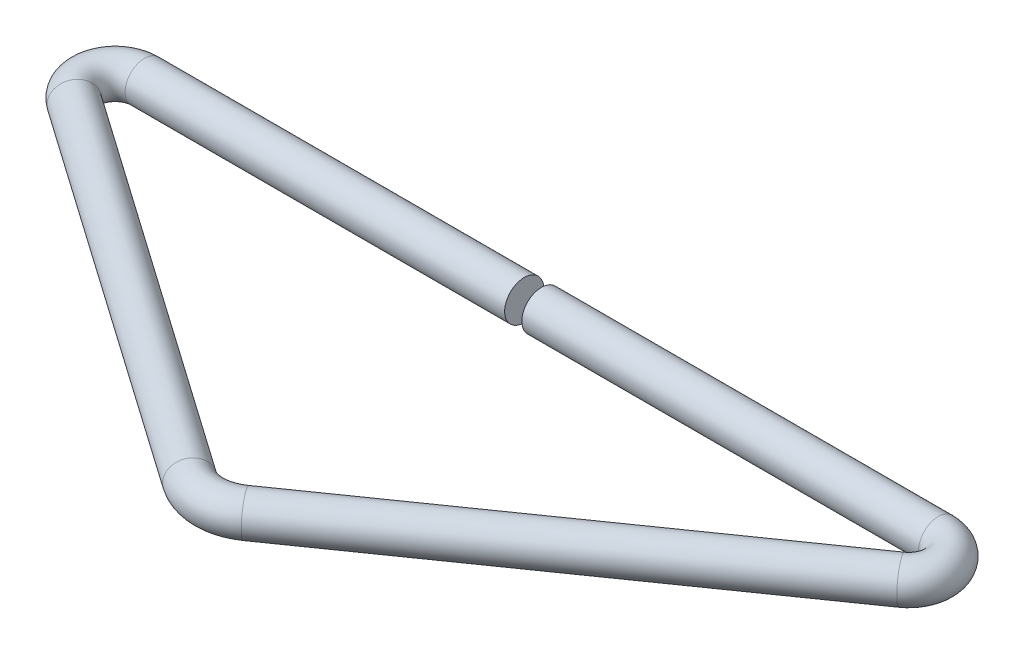
ISO-10303-21;
HEADER;
FILE_DESCRIPTION(('STEP AP214'),'2;1');
FILE_NAME('part.step','',(''),(''),'','','');
FILE_SCHEMA(('AUTOMOTIVE_DESIGN { 1 0 10303 214 1 1 1 1 }'));
ENDSEC;
DATA;
#1=APPLICATION_CONTEXT('core data for automotive mechanical design processes');
#2=APPLICATION_PROTOCOL_DEFINITION('international standard','automotive_design',2000,#1);
#3=PRODUCT_CONTEXT('',#1,'mechanical');
#4=PRODUCT('Part','Part','',(#3));
#5=PRODUCT_RELATED_PRODUCT_CATEGORY('part','',(#4));
#6=PRODUCT_DEFINITION_FORMATION('','',#4);
#7=PRODUCT_DEFINITION_CONTEXT('part definition',#1,'design');
#8=PRODUCT_DEFINITION('design','',#6,#7);
#9=PRODUCT_DEFINITION_SHAPE('','',#8);
#10=(LENGTH_UNIT() NAMED_UNIT(*) SI_UNIT(.MILLI.,.METRE.));
#11=(NAMED_UNIT(*) PLANE_ANGLE_UNIT() SI_UNIT($,.RADIAN.));
#12=(NAMED_UNIT(*) SI_UNIT($,.STERADIAN.) SOLID_ANGLE_UNIT());
#13=UNCERTAINTY_MEASURE_WITH_UNIT(LENGTH_MEASURE(1.E-05),#10,'distance_accuracy_value','');
#14=(GEOMETRIC_REPRESENTATION_CONTEXT(3) GLOBAL_UNCERTAINTY_ASSIGNED_CONTEXT((#13)) GLOBAL_UNIT_ASSIGNED_CONTEXT((#10,
#11,#12)) REPRESENTATION_CONTEXT('',''));
#15=CARTESIAN_POINT('',(0.,0.,0.));
#16=DIRECTION('',(0.,0.,1.));
#17=DIRECTION('',(1.,0.,0.));
#18=AXIS2_PLACEMENT_3D('',#15,#16,#17);
#19=CARTESIAN_POINT('',(-40.4852155929103,0.,0.));
#20=DIRECTION('',(1.,0.,0.));
#21=DIRECTION('',(0.,0.,-1.));
#22=AXIS2_PLACEMENT_3D('',#19,#20,#21);
#23=CYLINDRICAL_SURFACE('',#22,2.);
#24=CARTESIAN_POINT('',(-40.4852155929103,0.,0.));
#25=DIRECTION('',(1.,0.,0.));
#26=DIRECTION('',(0.,0.,-1.));
#27=AXIS2_PLACEMENT_3D('',#24,#25,#26);
#28=CIRCLE('',#27,2.);
#29=CARTESIAN_POINT('',(-40.4852155929103,0.,-2.));
#30=VERTEX_POINT('',#29);
#31=EDGE_CURVE('E38',#30,#30,#28,.T.);
#32=ORIENTED_EDGE('',*,*,#31,.T.);
#33=EDGE_LOOP('',(#32));
#34=FACE_BOUND('',#33,.T.);
#35=CARTESIAN_POINT('',(-1.75439268877562,0.,0.));
#36=DIRECTION('',(1.,0.,0.));
#37=DIRECTION('',(0.,0.,-1.));
#38=AXIS2_PLACEMENT_3D('',#35,#36,#37);
#39=CIRCLE('',#38,2.);
#40=CARTESIAN_POINT('',(-1.75439268877563,0.,-2.00000000000001));
#41=VERTEX_POINT('',#40);
#42=EDGE_CURVE('E10',#41,#41,#39,.T.);
#43=ORIENTED_EDGE('',*,*,#42,.F.);
#44=EDGE_LOOP('',(#43));
#45=FACE_BOUND('',#44,.T.);
#46=ADVANCED_FACE('F32',(#34,#45),#23,.T.);
#47=CARTESIAN_POINT('',(-40.4852155929103,0.,3.));
#48=DIRECTION('',(0.,-1.,0.));
#49=DIRECTION('',(0.,0.,-1.));
#50=AXIS2_PLACEMENT_3D('',#47,#48,#49);
#51=TOROIDAL_SURFACE('',#50,3.,2.);
#52=CARTESIAN_POINT('',(-42.2059449019634,0.,5.45745613286699));
#53=DIRECTION('',(-0.819152044288997,0.,-0.573576436351039));
#54=DIRECTION('',(-0.573576436351039,0.,0.819152044288997));
#55=AXIS2_PLACEMENT_3D('',#52,#53,#54);
#56=CIRCLE('',#55,2.);
#57=CARTESIAN_POINT('',(-43.3530977746655,0.,7.09576022144498));
#58=VERTEX_POINT('',#57);
#59=EDGE_CURVE('E42',#58,#58,#56,.T.);
#60=CARTESIAN_POINT('',(-40.4852155929103,0.,3.));
#61=DIRECTION('',(0.,-1.,0.));
#62=DIRECTION('',(0.,0.,-1.));
#63=AXIS2_PLACEMENT_3D('',#60,#61,#62);
#64=CIRCLE('',#63,5.);
#65=EDGE_CURVE('',#58,#30,#64,.T.);
#66=ORIENTED_EDGE('',*,*,#59,.T.);
#67=ORIENTED_EDGE('',*,*,#31,.F.);
#68=ORIENTED_EDGE('',*,*,#65,.T.);
#69=ORIENTED_EDGE('',*,*,#65,.F.);
#70=EDGE_LOOP('',(#66,#68,#67,#69));
#71=FACE_BOUND('',#70,.T.);
#72=ADVANCED_FACE('F82',(#71),#51,.T.);
#73=CARTESIAN_POINT('',(-2.8678821817552,0.,33.0022641881228));
#74=DIRECTION('',(-0.819152044288995,0.,-0.573576436351041));
#75=DIRECTION('',(-0.573576436351041,0.,0.819152044288995));
#76=AXIS2_PLACEMENT_3D('',#73,#74,#75);
#77=CYLINDRICAL_SURFACE('',#76,2.);
#78=CARTESIAN_POINT('',(-2.8678821817552,0.,33.0022641881228));
#79=DIRECTION('',(-0.819152044288997,0.,-0.573576436351039));
#80=DIRECTION('',(-0.573576436351039,0.,0.819152044288997));
#81=AXIS2_PLACEMENT_3D('',#78,#79,#80);
#82=CIRCLE('',#81,2.);
#83=CARTESIAN_POINT('',(-4.01503505445728,0.,34.6405682767008));
#84=VERTEX_POINT('',#83);
#85=EDGE_CURVE('E46',#84,#84,#82,.T.);
#86=ORIENTED_EDGE('',*,*,#85,.T.);
#87=EDGE_LOOP('',(#86));
#88=FACE_BOUND('',#87,.T.);
#89=ORIENTED_EDGE('',*,*,#59,.F.);
#90=EDGE_LOOP('',(#89));
#91=FACE_BOUND('',#90,.T.);
#92=ADVANCED_FACE('F86',(#88,#91),#77,.T.);
#93=CARTESIAN_POINT('',(0.,0.,28.9065039666778));
#94=DIRECTION('',(0.,-1.,0.));
#95=DIRECTION('',(0.,0.,-1.));
#96=AXIS2_PLACEMENT_3D('',#93,#94,#95);
#97=TOROIDAL_SURFACE('',#96,5.,2.);
#98=CARTESIAN_POINT('',(2.86788218175521,0.,33.0022641881228));
#99=DIRECTION('',(-0.819152044288994,0.,0.573576436351042));
#100=DIRECTION('',(0.573576436351042,0.,0.819152044288994));
#101=AXIS2_PLACEMENT_3D('',#98,#99,#100);
#102=CIRCLE('',#101,2.);
#103=CARTESIAN_POINT('',(4.01503505445729,0.,34.6405682767008));
#104=VERTEX_POINT('',#103);
#105=EDGE_CURVE('E51',#104,#104,#102,.T.);
#106=CARTESIAN_POINT('',(0.,0.,28.9065039666778));
#107=DIRECTION('',(0.,-1.,0.));
#108=DIRECTION('',(0.,0.,-1.));
#109=AXIS2_PLACEMENT_3D('',#106,#107,#108);
#110=CIRCLE('',#109,7.);
#111=EDGE_CURVE('',#104,#84,#110,.T.);
#112=ORIENTED_EDGE('',*,*,#105,.T.);
#113=ORIENTED_EDGE('',*,*,#85,.F.);
#114=ORIENTED_EDGE('',*,*,#111,.T.);
#115=ORIENTED_EDGE('',*,*,#111,.F.);
#116=EDGE_LOOP('',(#112,#114,#113,#115));
#117=FACE_BOUND('',#116,.T.);
#118=ADVANCED_FACE('F92',(#117),#97,.T.);
#119=CARTESIAN_POINT('',(42.2059449019634,0.,5.45745613286698));
#120=DIRECTION('',(-0.819152044288995,0.,0.573576436351042));
#121=DIRECTION('',(0.573576436351042,0.,0.819152044288995));
#122=AXIS2_PLACEMENT_3D('',#119,#120,#121);
#123=CYLINDRICAL_SURFACE('',#122,2.);
#124=CARTESIAN_POINT('',(42.2059449019634,0.,5.45745613286698));
#125=DIRECTION('',(-0.819152044288994,0.,0.573576436351042));
#126=DIRECTION('',(0.573576436351042,0.,0.819152044288994));
#127=AXIS2_PLACEMENT_3D('',#124,#125,#126);
#128=CIRCLE('',#127,2.);
#129=CARTESIAN_POINT('',(43.3530977746655,0.,7.09576022144497));
#130=VERTEX_POINT('',#129);
#131=EDGE_CURVE('E54',#130,#130,#128,.T.);
#132=ORIENTED_EDGE('',*,*,#131,.T.);
#133=EDGE_LOOP('',(#132));
#134=FACE_BOUND('',#133,.T.);
#135=ORIENTED_EDGE('',*,*,#105,.F.);
#136=EDGE_LOOP('',(#135));
#137=FACE_BOUND('',#136,.T.);
#138=ADVANCED_FACE('F99',(#134,#137),#123,.T.);
#139=CARTESIAN_POINT('',(40.4852155929103,0.,3.));
#140=DIRECTION('',(0.,-1.,0.));
#141=DIRECTION('',(0.,0.,-1.));
#142=AXIS2_PLACEMENT_3D('',#139,#140,#141);
#143=TOROIDAL_SURFACE('',#142,3.,2.);
#144=CARTESIAN_POINT('',(40.4852155929103,0.,0.));
#145=DIRECTION('',(1.,0.,0.));
#146=DIRECTION('',(0.,0.,-1.));
#147=AXIS2_PLACEMENT_3D('',#144,#145,#146);
#148=CIRCLE('',#147,2.);
#149=CARTESIAN_POINT('',(40.4852155929103,0.,-2.));
#150=VERTEX_POINT('',#149);
#151=EDGE_CURVE('E57',#150,#150,#148,.T.);
#152=CARTESIAN_POINT('',(40.4852155929103,0.,3.));
#153=DIRECTION('',(0.,-1.,0.));
#154=DIRECTION('',(0.,0.,-1.));
#155=AXIS2_PLACEMENT_3D('',#152,#153,#154);
#156=CIRCLE('',#155,5.);
#157=EDGE_CURVE('',#150,#130,#156,.T.);
#158=ORIENTED_EDGE('',*,*,#151,.T.);
#159=ORIENTED_EDGE('',*,*,#131,.F.);
#160=ORIENTED_EDGE('',*,*,#157,.T.);
#161=ORIENTED_EDGE('',*,*,#157,.F.);
#162=EDGE_LOOP('',(#158,#160,#159,#161));
#163=FACE_BOUND('',#162,.T.);
#164=ADVANCED_FACE('F64',(#163),#143,.T.);
#165=CARTESIAN_POINT('',(40.4852155929103,0.,0.));
#166=DIRECTION('',(-1.,0.,0.));
#167=DIRECTION('',(0.,0.,1.));
#168=AXIS2_PLACEMENT_3D('',#165,#166,#167);
#169=CYLINDRICAL_SURFACE('',#168,2.);
#170=ORIENTED_EDGE('',*,*,#151,.F.);
#171=EDGE_LOOP('',(#170));
#172=FACE_BOUND('',#171,.T.);
#173=CARTESIAN_POINT('',(0.,0.,0.));
#174=DIRECTION('',(1.,0.,0.));
#175=DIRECTION('',(0.,0.,-1.));
#176=AXIS2_PLACEMENT_3D('',#173,#174,#175);
#177=CIRCLE('',#176,2.);
#178=CARTESIAN_POINT('',(0.,0.,-2.));
#179=VERTEX_POINT('',#178);
#180=EDGE_CURVE('E58',#179,#179,#177,.T.);
#181=ORIENTED_EDGE('',*,*,#180,.T.);
#182=EDGE_LOOP('',(#181));
#183=FACE_BOUND('',#182,.T.);
#184=ADVANCED_FACE('F67',(#172,#183),#169,.T.);
#185=CARTESIAN_POINT('',(-1.75439268877562,0.,0.));
#186=DIRECTION('',(1.,0.,0.));
#187=DIRECTION('',(0.,0.,-1.));
#188=AXIS2_PLACEMENT_3D('',#185,#186,#187);
#189=PLANE('',#188);
#190=ORIENTED_EDGE('',*,*,#42,.T.);
#191=EDGE_LOOP('',(#190));
#192=FACE_BOUND('',#191,.T.);
#193=ADVANCED_FACE('F70',(#192),#189,.T.);
#194=CARTESIAN_POINT('',(0.,0.,0.));
#195=DIRECTION('',(1.,0.,0.));
#196=DIRECTION('',(0.,0.,-1.));
#197=AXIS2_PLACEMENT_3D('',#194,#195,#196);
#198=PLANE('',#197);
#199=ORIENTED_EDGE('',*,*,#180,.F.);
#200=EDGE_LOOP('',(#199));
#201=FACE_BOUND('',#200,.T.);
#202=ADVANCED_FACE('F74',(#201),#198,.F.);
#203=CLOSED_SHELL('',(#46,#72,#92,#118,#138,#164,#184,#193,#202));
#204=MANIFOLD_SOLID_BREP('B2',#203);
#205=ADVANCED_BREP_SHAPE_REPRESENTATION('',(#18,#204),#14);
#206=SHAPE_DEFINITION_REPRESENTATION(#9,#205);
ENDSEC;
END-ISO-10303-21;
